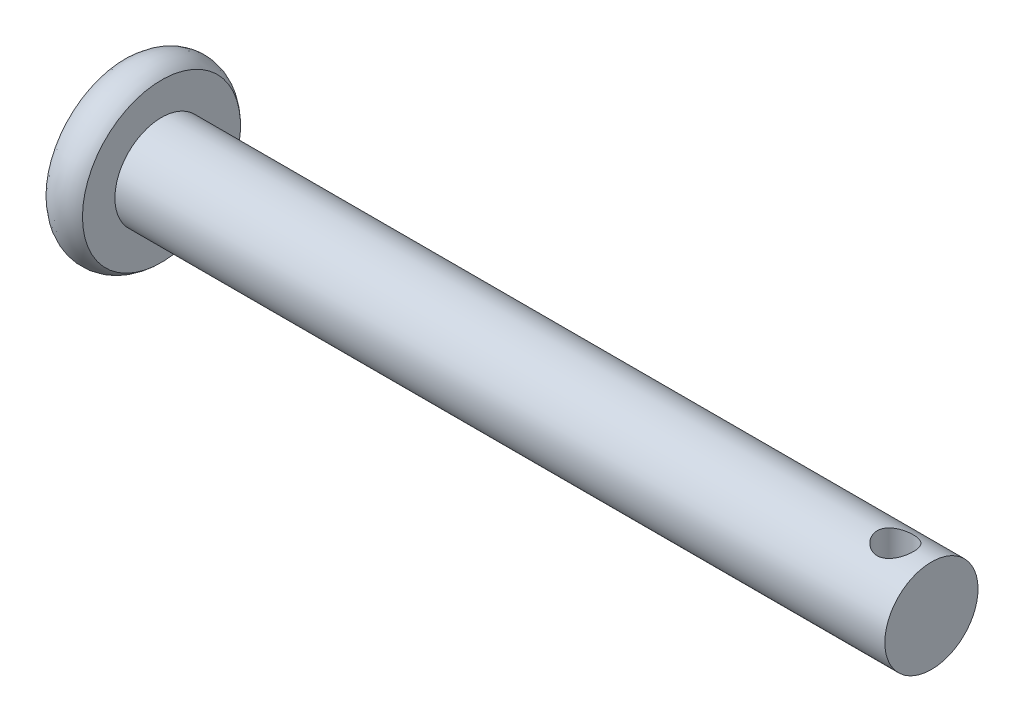
ISO-10303-21;
HEADER;
FILE_DESCRIPTION(('STEP AP214'),'2;1');
FILE_NAME('part.step','',(''),(''),'','','');
FILE_SCHEMA(('AUTOMOTIVE_DESIGN { 1 0 10303 214 1 1 1 1 }'));
ENDSEC;
DATA;
#1=APPLICATION_CONTEXT('core data for automotive mechanical design processes');
#2=APPLICATION_PROTOCOL_DEFINITION('international standard','automotive_design',2000,#1);
#3=PRODUCT_CONTEXT('',#1,'mechanical');
#4=PRODUCT('Part','Part','',(#3));
#5=PRODUCT_RELATED_PRODUCT_CATEGORY('part','',(#4));
#6=PRODUCT_DEFINITION_FORMATION('','',#4);
#7=PRODUCT_DEFINITION_CONTEXT('part definition',#1,'design');
#8=PRODUCT_DEFINITION('design','',#6,#7);
#9=PRODUCT_DEFINITION_SHAPE('','',#8);
#10=(LENGTH_UNIT() NAMED_UNIT(*) SI_UNIT(.MILLI.,.METRE.));
#11=(NAMED_UNIT(*) PLANE_ANGLE_UNIT() SI_UNIT($,.RADIAN.));
#12=(NAMED_UNIT(*) SI_UNIT($,.STERADIAN.) SOLID_ANGLE_UNIT());
#13=UNCERTAINTY_MEASURE_WITH_UNIT(LENGTH_MEASURE(1.E-05),#10,'distance_accuracy_value','');
#14=(GEOMETRIC_REPRESENTATION_CONTEXT(3) GLOBAL_UNCERTAINTY_ASSIGNED_CONTEXT((#13)) GLOBAL_UNIT_ASSIGNED_CONTEXT((#10,
#11,#12)) REPRESENTATION_CONTEXT('',''));
#15=CARTESIAN_POINT('',(0.,0.,0.));
#16=DIRECTION('',(0.,0.,1.));
#17=DIRECTION('',(1.,0.,0.));
#18=AXIS2_PLACEMENT_3D('',#15,#16,#17);
#19=CARTESIAN_POINT('',(-14.257685783,3.9,0.));
#20=DIRECTION('',(1.,0.,0.));
#21=DIRECTION('',(0.,0.,-1.));
#22=AXIS2_PLACEMENT_3D('',#19,#20,#21);
#23=PLANE('',#22);
#24=CARTESIAN_POINT('',(-14.257685783,0.,0.));
#25=DIRECTION('',(-1.,0.,0.));
#26=DIRECTION('',(0.,0.,1.));
#27=AXIS2_PLACEMENT_3D('',#24,#25,#26);
#28=CIRCLE('',#27,3.899999999713);
#29=CARTESIAN_POINT('',(-14.257685783,0.,3.899999999713));
#30=VERTEX_POINT('',#29);
#31=EDGE_CURVE('E18',#30,#30,#28,.F.);
#32=ORIENTED_EDGE('',*,*,#31,.F.);
#33=EDGE_LOOP('',(#32));
#34=FACE_BOUND('',#33,.T.);
#35=ADVANCED_FACE('F15',(#34),#23,.F.);
#36=CARTESIAN_POINT('',(-14.2576857828368,0.,3.89999999987616));
#37=CARTESIAN_POINT('',(-13.7304779890289,0.,4.42720779368412));
#38=CARTESIAN_POINT('',(-12.9848935768368,0.,4.42720779368411));
#39=CARTESIAN_POINT('',(-12.4576857830289,0.,3.89999999987614));
#40=(BOUNDED_CURVE() B_SPLINE_CURVE(3,(#36,#37,#38,#39),.UNSPECIFIED.,.F.,
.F.) B_SPLINE_CURVE_WITH_KNOTS((4,4),(0.,1.),
.UNSPECIFIED.) CURVE() GEOMETRIC_REPRESENTATION_ITEM() RATIONAL_B_SPLINE_CURVE((1.,
0.804737854124365,0.804737854124365,1.)) REPRESENTATION_ITEM(''));
#41=CARTESIAN_POINT('',(-13.357685783,0.,0.));
#42=DIRECTION('',(-1.,0.,0.));
#43=AXIS1_PLACEMENT('',#41,#42);
#44=SURFACE_OF_REVOLUTION('',#40,#43);
#45=CARTESIAN_POINT('',(-12.457685783,0.,0.));
#46=DIRECTION('',(-1.,0.,0.));
#47=DIRECTION('',(0.,0.,1.));
#48=AXIS2_PLACEMENT_3D('',#45,#46,#47);
#49=CIRCLE('',#48,3.89999999984727);
#50=CARTESIAN_POINT('',(-12.457685783,0.,3.89999999984727));
#51=VERTEX_POINT('',#50);
#52=EDGE_CURVE('E111',#51,#51,#49,.F.);
#53=ORIENTED_EDGE('',*,*,#52,.F.);
#54=EDGE_LOOP('',(#53));
#55=FACE_BOUND('',#54,.T.);
#56=ORIENTED_EDGE('',*,*,#31,.T.);
#57=EDGE_LOOP('',(#56));
#58=FACE_BOUND('',#57,.T.);
#59=ADVANCED_FACE('F54',(#55,#58),#44,.F.);
#60=CARTESIAN_POINT('',(25.542314217,0.,0.));
#61=DIRECTION('',(-1.,0.,0.));
#62=DIRECTION('',(0.,0.,1.));
#63=AXIS2_PLACEMENT_3D('',#60,#61,#62);
#64=PLANE('',#63);
#65=CARTESIAN_POINT('',(25.542314217,0.,0.));
#66=DIRECTION('',(-1.,0.,0.));
#67=DIRECTION('',(0.,-1.,0.));
#68=AXIS2_PLACEMENT_3D('',#65,#66,#67);
#69=CIRCLE('',#68,2.3);
#70=CARTESIAN_POINT('',(25.542314217,-2.30000000000001,0.));
#71=VERTEX_POINT('',#70);
#72=EDGE_CURVE('E114',#71,#71,#69,.T.);
#73=ORIENTED_EDGE('',*,*,#72,.F.);
#74=EDGE_LOOP('',(#73));
#75=FACE_BOUND('',#74,.T.);
#76=ADVANCED_FACE('F51',(#75),#64,.F.);
#77=CARTESIAN_POINT('',(-12.457685783,2.3,0.));
#78=DIRECTION('',(-1.,0.,0.));
#79=DIRECTION('',(0.,0.,1.));
#80=AXIS2_PLACEMENT_3D('',#77,#78,#79);
#81=PLANE('',#80);
#82=CARTESIAN_POINT('',(-12.457685783,0.,0.));
#83=DIRECTION('',(-1.,0.,0.));
#84=DIRECTION('',(0.,-1.,0.));
#85=AXIS2_PLACEMENT_3D('',#82,#83,#84);
#86=CIRCLE('',#85,2.3);
#87=CARTESIAN_POINT('',(-12.457685783,-2.3,0.));
#88=VERTEX_POINT('',#87);
#89=EDGE_CURVE('E27',#88,#88,#86,.F.);
#90=ORIENTED_EDGE('',*,*,#89,.F.);
#91=EDGE_LOOP('',(#90));
#92=FACE_BOUND('',#91,.T.);
#93=ORIENTED_EDGE('',*,*,#52,.T.);
#94=EDGE_LOOP('',(#93));
#95=FACE_BOUND('',#94,.T.);
#96=ADVANCED_FACE('F46',(#92,#95),#81,.F.);
#97=CARTESIAN_POINT('',(-12.457685783,0.,0.));
#98=DIRECTION('',(-1.,0.,0.));
#99=DIRECTION('',(0.,-1.,0.));
#100=AXIS2_PLACEMENT_3D('',#97,#98,#99);
#101=CYLINDRICAL_SURFACE('',#100,2.3);
#102=ORIENTED_EDGE('',*,*,#89,.T.);
#103=EDGE_LOOP('',(#102));
#104=FACE_BOUND('',#103,.T.);
#105=CARTESIAN_POINT('',(23.762820109,2.11960548226938,-0.892901225949819));
#106=CARTESIAN_POINT('',(23.7148153781979,2.11960837593618,-0.892898292083054));
#107=CARTESIAN_POINT('',(23.6667664062882,2.12125766769497,-0.889010187214511));
#108=CARTESIAN_POINT('',(23.5720766638275,2.1276436226949,-0.873612237687491));
#109=CARTESIAN_POINT('',(23.5254381926313,2.13238506978472,-0.862090582784489));
#110=CARTESIAN_POINT('',(23.4350417104632,2.1443328046021,-0.831923655590605));
#111=CARTESIAN_POINT('',(23.3912749433457,2.15153114058072,-0.813301342162308));
#112=CARTESIAN_POINT('',(23.3074847954919,2.1675707255735,-0.769531267699749));
#113=CARTESIAN_POINT('',(23.2674615020448,2.1764120128831,-0.744383354555326));
#114=CARTESIAN_POINT('',(23.1901358605708,2.19527208085859,-0.686832934393373));
#115=CARTESIAN_POINT('',(23.1530607404539,2.20532722685145,-0.654136920562359));
#116=CARTESIAN_POINT('',(23.0847571851557,2.22518017728969,-0.583038952624936));
#117=CARTESIAN_POINT('',(23.0535303427025,2.23497791100828,-0.544635449225455));
#118=CARTESIAN_POINT('',(22.9966977498751,2.25364654363507,-0.461472230071028));
#119=CARTESIAN_POINT('',(22.9713413069026,2.26247003270787,-0.416530540823756));
#120=CARTESIAN_POINT('',(22.9286442063295,2.27775714481733,-0.322615710217668));
#121=CARTESIAN_POINT('',(22.9113005578524,2.2842216481855,-0.27364408113898));
#122=CARTESIAN_POINT('',(22.885925550209,2.2938046348843,-0.175444709389579));
#123=CARTESIAN_POINT('',(22.8775032728692,2.29706308956369,-0.126331910940691));
#124=CARTESIAN_POINT('',(22.8689542779818,2.30037103898935,-0.0272891679768998));
#125=CARTESIAN_POINT('',(22.8688246604055,2.30042165554965,0.0226404847656051));
#126=CARTESIAN_POINT('',(22.8766439666058,2.29739524719843,0.119085411360107));
#127=CARTESIAN_POINT('',(22.8841653808557,2.29448373319023,0.165641462154227));
#128=CARTESIAN_POINT('',(22.906349960255,2.28608041777045,0.25677072904193));
#129=CARTESIAN_POINT('',(22.9210136520279,2.28058842609281,0.301343798659269));
#130=CARTESIAN_POINT('',(22.9572492120109,2.26746189411858,0.388031831174553));
#131=CARTESIAN_POINT('',(22.9789206306783,2.25979668762066,0.430100346252291));
#132=CARTESIAN_POINT('',(23.0284649452693,2.2430920253586,0.510108800901238));
#133=CARTESIAN_POINT('',(23.0563396615283,2.23405216645472,0.548047523723268));
#134=CARTESIAN_POINT('',(23.1195209887997,2.21485908208926,0.621223181342974));
#135=CARTESIAN_POINT('',(23.1551817665482,2.20467157831507,0.656145761771504));
#136=CARTESIAN_POINT('',(23.231916333415,2.18476890587343,0.71964936967132));
#137=CARTESIAN_POINT('',(23.272993241784,2.17505401383939,0.748226717154435));
#138=CARTESIAN_POINT('',(23.3607337294702,2.15696834646087,0.798894107710594));
#139=CARTESIAN_POINT('',(23.4075145110434,2.14863893385829,0.820796816127147));
#140=CARTESIAN_POINT('',(23.5044654388856,2.13475790250726,0.85625760015814));
#141=CARTESIAN_POINT('',(23.5546280351164,2.12920031437944,0.869833622682813));
#142=CARTESIAN_POINT('',(23.631545675529,2.12350831623707,0.88359154756072));
#143=CARTESIAN_POINT('',(23.6576524787044,2.12205103749954,0.887077110977887));
#144=CARTESIAN_POINT('',(23.7101084441207,2.12009882788941,0.891732751185142));
#145=CARTESIAN_POINT('',(23.7364576053991,2.11960389319683,0.892902837166395));
#146=CARTESIAN_POINT('',(23.8108248397948,2.11960837598079,0.892898292150838));
#147=CARTESIAN_POINT('',(23.8588738117037,2.1212576677066,0.889010187233493));
#148=CARTESIAN_POINT('',(23.9535635541668,2.12764362268233,0.873612237670717));
#149=CARTESIAN_POINT('',(24.000202025366,2.13238506978117,0.862090582780501));
#150=CARTESIAN_POINT('',(24.0905985075377,2.14433280460541,0.831923655595166));
#151=CARTESIAN_POINT('',(24.1343652746558,2.15153114058183,0.813301342162965));
#152=CARTESIAN_POINT('',(24.2181554225094,2.16757072557294,0.769531267697598));
#153=CARTESIAN_POINT('',(24.2581787159559,2.17641201288302,0.744383354554492));
#154=CARTESIAN_POINT('',(24.3355043574289,2.19527208085875,0.686832934393993));
#155=CARTESIAN_POINT('',(24.3725794775455,2.20532722685135,0.65413692056301));
#156=CARTESIAN_POINT('',(24.4408830328438,2.22518017728946,0.583038952625483));
#157=CARTESIAN_POINT('',(24.4721098752972,2.23497791100819,0.544635449225772));
#158=CARTESIAN_POINT('',(24.528942468125,2.25364654363512,0.46147223007092));
#159=CARTESIAN_POINT('',(24.5542989110976,2.26247003270793,0.416530540823476));
#160=CARTESIAN_POINT('',(24.5969960116706,2.27775714481737,0.322615710217348));
#161=CARTESIAN_POINT('',(24.6143396601476,2.28422164818551,0.273644081138818));
#162=CARTESIAN_POINT('',(24.639714667791,2.2938046348843,0.175444709389611));
#163=CARTESIAN_POINT('',(24.6481369451308,2.29706308956369,0.126331910940753));
#164=CARTESIAN_POINT('',(24.6566859400182,2.30037103898935,0.0272891679769617));
#165=CARTESIAN_POINT('',(24.6568155575945,2.30042165554965,-0.0226404847655741));
#166=CARTESIAN_POINT('',(24.6489962513942,2.29739524719843,-0.119085411360054));
#167=CARTESIAN_POINT('',(24.6414748371443,2.29448373319024,-0.165641462154123));
#168=CARTESIAN_POINT('',(24.6192902577451,2.28608041777046,-0.256770729041828));
#169=CARTESIAN_POINT('',(24.6046265659721,2.28058842609282,-0.301343798659218));
#170=CARTESIAN_POINT('',(24.568391005989,2.26746189411855,-0.388031831174733));
#171=CARTESIAN_POINT('',(24.5467195873215,2.2597966876206,-0.430100346252642));
#172=CARTESIAN_POINT('',(24.4971752727305,2.24309202535852,-0.510108800901537));
#173=CARTESIAN_POINT('',(24.4693005564715,2.23405216645466,-0.548047523723378));
#174=CARTESIAN_POINT('',(24.4061192292006,2.21485908208939,-0.621223181342618));
#175=CARTESIAN_POINT('',(24.3704584514525,2.20467157831538,-0.656145761770917));
#176=CARTESIAN_POINT('',(24.2937238845858,2.18476890587353,-0.719649369670582));
#177=CARTESIAN_POINT('',(24.2526469762164,2.17505401383913,-0.748226717153645));
#178=CARTESIAN_POINT('',(24.164906488529,2.15696834646106,-0.798894107711597));
#179=CARTESIAN_POINT('',(24.1181257069549,2.14863893385935,-0.820796816129981));
#180=CARTESIAN_POINT('',(24.0211747791126,2.1347579025057,-0.856257600156586));
#181=CARTESIAN_POINT('',(23.9710121828825,2.1292003143743,-0.869833622675352));
#182=CARTESIAN_POINT('',(23.8940945424707,2.12350831623961,-0.883591547564662));
#183=CARTESIAN_POINT('',(23.867987739295,2.1220510375069,-0.887077110989131));
#184=CARTESIAN_POINT('',(23.8155317738766,2.12009882788193,-0.891732751174193));
#185=CARTESIAN_POINT('',(23.7891826125962,2.11960389316972,-0.892902837125881));
#186=CARTESIAN_POINT('',(23.762820109,2.11960548226938,-0.892901225949819));
#187=B_SPLINE_CURVE_WITH_KNOTS('',3,(#105,#106,#107,#108,#109,#110,#111,#112,#113,#114,#115,
#116,#117,#118,#119,#120,#121,#122,#123,#124,#125,#126,#127,#128,#129,#130,#131,#132,#133,#134,
#135,#136,#137,#138,#139,#140,#141,#142,#143,#144,#145,#146,#147,#148,#149,#150,#151,#152,#153,
#154,#155,#156,#157,#158,#159,#160,#161,#162,#163,#164,#165,#166,#167,#168,#169,#170,#171,#172,
#173,#174,#175,#176,#177,#178,#179,#180,#181,#182,#183,#184,#185,#186),.UNSPECIFIED.,.T.,.F.,(4,
2,2,2,2,2,2,2,2,2,2,2,2,2,2,2,2,2,2,2,2,2,2,2,2,2,2,2,2,2,2,2,2,2,2,2,2,2,2,2,4),(0.,
0.143910645308526,0.288044463487623,0.431716146178508,0.575391178122672,0.726058734110936,
0.876767263630015,1.03302496062168,1.18922428524249,1.3382535779824,1.48723075335646,
1.62831747827091,1.76941460754864,1.91261133938583,2.05585014733272,2.20798922480796,
2.36021630788621,2.51638881394691,2.67222351995955,2.7512544800436,2.83028512641785,
2.9741957717277,3.11832958991487,3.26200127260821,3.40567630454992,3.55634386053692,
3.70705239005726,3.86331008704942,4.01950941166974,4.16853870440955,4.31751587978371,
4.45860260469799,4.59969973397589,4.74289646581366,4.88613527375997,5.03827435123363,
5.19050143431346,5.34667394037695,5.5025086463868,5.58153960647213,5.66057025284999),.UNSPECIFIED.);
#188=CARTESIAN_POINT('',(23.762820109,2.11960548226938,-0.892901225949819));
#189=VERTEX_POINT('',#188);
#190=EDGE_CURVE('E10',#189,#189,#187,.T.);
#191=ORIENTED_EDGE('',*,*,#190,.F.);
#192=EDGE_LOOP('',(#191));
#193=FACE_BOUND('',#192,.T.);
#194=ORIENTED_EDGE('',*,*,#72,.T.);
#195=EDGE_LOOP('',(#194));
#196=FACE_BOUND('',#195,.T.);
#197=CARTESIAN_POINT('',(23.762820109,-2.11960548226154,0.892901225937967));
#198=CARTESIAN_POINT('',(23.7148153781976,-2.11960837592563,0.892898292067127));
#199=CARTESIAN_POINT('',(23.6667664062876,-2.1212576676922,0.889010187210169));
#200=CARTESIAN_POINT('',(23.5720766638271,-2.12764362269781,0.873612237691663));
#201=CARTESIAN_POINT('',(23.5254381926315,-2.1323850697855,0.86209058278565));
#202=CARTESIAN_POINT('',(23.4350417104641,-2.14433280460124,0.831923655589799));
#203=CARTESIAN_POINT('',(23.3912749433468,-2.15153114058035,0.813301342162506));
#204=CARTESIAN_POINT('',(23.3074847954932,-2.16757072557347,0.769531267700797));
#205=CARTESIAN_POINT('',(23.2674615020459,-2.17641201288293,0.744383354556169));
#206=CARTESIAN_POINT('',(23.1901358605717,-2.19527208085832,0.686832934394054));
#207=CARTESIAN_POINT('',(23.1530607404547,-2.20532722685124,0.654136920563094));
#208=CARTESIAN_POINT('',(23.0847571851565,-2.22518017728951,0.583038952625814));
#209=CARTESIAN_POINT('',(23.0535303427033,-2.23497791100807,0.544635449226444));
#210=CARTESIAN_POINT('',(22.9966977498758,-2.25364654363485,0.461472230072215));
#211=CARTESIAN_POINT('',(22.9713413069033,-2.26247003270766,0.416530540825024));
#212=CARTESIAN_POINT('',(22.92864420633,-2.27775714481717,0.322615710219013));
#213=CARTESIAN_POINT('',(22.9113005578528,-2.28422164818537,0.273644081140314));
#214=CARTESIAN_POINT('',(22.8859255502092,-2.29380463488423,0.175444709390888));
#215=CARTESIAN_POINT('',(22.8775032728694,-2.29706308956365,0.126331910941986));
#216=CARTESIAN_POINT('',(22.8689542779818,-2.30037103898937,0.0272891679781779));
#217=CARTESIAN_POINT('',(22.8688246604055,-2.30042165554969,-0.0226404847643295));
#218=CARTESIAN_POINT('',(22.8766439666056,-2.29739524719852,-0.119085411358849));
#219=CARTESIAN_POINT('',(22.8841653808555,-2.29448373319035,-0.165641462152983));
#220=CARTESIAN_POINT('',(22.9063499602546,-2.28608041777061,-0.25677072904073));
#221=CARTESIAN_POINT('',(22.9210136520275,-2.280588426093,-0.3013437986581));
#222=CARTESIAN_POINT('',(22.9572492120104,-2.2674618941188,-0.388031831173437));
#223=CARTESIAN_POINT('',(22.9789206306777,-2.25979668762089,-0.430100346251199));
#224=CARTESIAN_POINT('',(23.0284649452686,-2.24309202535887,-0.510108800900201));
#225=CARTESIAN_POINT('',(23.0563396615276,-2.23405216645499,-0.548047523722264));
#226=CARTESIAN_POINT('',(23.1195209887988,-2.21485908208955,-0.621223181342045));
#227=CARTESIAN_POINT('',(23.1551817665473,-2.20467157831536,-0.656145761770618));
#228=CARTESIAN_POINT('',(23.2319163334139,-2.18476890587371,-0.71964936967053));
#229=CARTESIAN_POINT('',(23.2729932417829,-2.17505401383967,-0.748226717153697));
#230=CARTESIAN_POINT('',(23.360733729469,-2.15696834646112,-0.798894107709982));
#231=CARTESIAN_POINT('',(23.4075145110422,-2.14863893385852,-0.820796816126606));
#232=CARTESIAN_POINT('',(23.5044654388843,-2.13475790250744,-0.856257600157748));
#233=CARTESIAN_POINT('',(23.5546280351151,-2.12920031437959,-0.869833622682497));
#234=CARTESIAN_POINT('',(23.6315456755276,-2.12350831623718,-0.883591547560516));
#235=CARTESIAN_POINT('',(23.657652478703,-2.12205103749964,-0.887077110977719));
#236=CARTESIAN_POINT('',(23.7101084441192,-2.12009882788947,-0.891732751185054));
#237=CARTESIAN_POINT('',(23.7364576053976,-2.11960389319688,-0.89290283716635));
#238=CARTESIAN_POINT('',(23.8108248397934,-2.11960837598079,-0.892898292150921));
#239=CARTESIAN_POINT('',(23.8588738117025,-2.12125766770657,-0.889010187233634));
#240=CARTESIAN_POINT('',(23.9535635541659,-2.12764362268228,-0.873612237670927));
#241=CARTESIAN_POINT('',(24.0002020253652,-2.13238506978111,-0.862090582780721));
#242=CARTESIAN_POINT('',(24.090598507537,-2.14433280460533,-0.831923655595439));
#243=CARTESIAN_POINT('',(24.134365274655,-2.15153114058172,-0.81330134216332));
#244=CARTESIAN_POINT('',(24.2181554225085,-2.16757072557278,-0.76953126769814));
#245=CARTESIAN_POINT('',(24.2581787159549,-2.17641201288283,-0.744383354555141));
#246=CARTESIAN_POINT('',(24.3355043574279,-2.19527208085852,-0.686832934394821));
#247=CARTESIAN_POINT('',(24.3725794775446,-2.20532722685111,-0.654136920563898));
#248=CARTESIAN_POINT('',(24.4408830328429,-2.22518017728922,-0.58303895262649));
#249=CARTESIAN_POINT('',(24.4721098752964,-2.23497791100796,-0.544635449226835));
#250=CARTESIAN_POINT('',(24.5289424681243,-2.25364654363491,-0.461472230072084));
#251=CARTESIAN_POINT('',(24.5542989110969,-2.26247003270773,-0.416530540824681));
#252=CARTESIAN_POINT('',(24.5969960116701,-2.27775714481721,-0.32261571021862));
#253=CARTESIAN_POINT('',(24.6143396601472,-2.28422164818538,-0.273644081140115));
#254=CARTESIAN_POINT('',(24.6397146677907,-2.29380463488423,-0.175444709390927));
#255=CARTESIAN_POINT('',(24.6481369451306,-2.29706308956364,-0.126331910942063));
#256=CARTESIAN_POINT('',(24.6566859400182,-2.30037103898937,-0.0272891679782543));
#257=CARTESIAN_POINT('',(24.6568155575945,-2.30042165554969,0.0226404847642916));
#258=CARTESIAN_POINT('',(24.6489962513944,-2.29739524719853,0.119085411358783));
#259=CARTESIAN_POINT('',(24.6414748371445,-2.29448373319036,0.165641462152853));
#260=CARTESIAN_POINT('',(24.6192902577454,-2.28608041777062,0.256770729040604));
#261=CARTESIAN_POINT('',(24.6046265659726,-2.280588426093,0.301343798658037));
#262=CARTESIAN_POINT('',(24.5683910059895,-2.26746189411877,0.388031831173661));
#263=CARTESIAN_POINT('',(24.546719587322,-2.25979668762083,0.430100346251635));
#264=CARTESIAN_POINT('',(24.4971752727312,-2.24309202535877,0.510108800900573));
#265=CARTESIAN_POINT('',(24.4693005564723,-2.23405216645492,0.548047523722401));
#266=CARTESIAN_POINT('',(24.4061192292016,-2.21485908208971,0.621223181341604));
#267=CARTESIAN_POINT('',(24.3704584514536,-2.20467157831574,0.656145761769891));
#268=CARTESIAN_POINT('',(24.2937238845871,-2.18476890587385,0.719649369669617));
#269=CARTESIAN_POINT('',(24.2526469762176,-2.17505401383935,0.748226717152721));
#270=CARTESIAN_POINT('',(24.16490648853,-2.15696834646136,0.798894107711222));
#271=CARTESIAN_POINT('',(24.1181257069558,-2.14863893385984,0.82079681613011));
#272=CARTESIAN_POINT('',(24.0211747791134,-2.13475790250552,0.856257600155826));
#273=CARTESIAN_POINT('',(23.9710121828835,-2.12920031437324,0.869833622673274));
#274=CARTESIAN_POINT('',(23.894094542472,-2.12350831624032,0.883591547565389));
#275=CARTESIAN_POINT('',(23.8679877392963,-2.12205103750873,0.88707711099162));
#276=CARTESIAN_POINT('',(23.8155317738774,-2.12009882788023,0.891732751171519));
#277=CARTESIAN_POINT('',(23.7891826125966,-2.11960389316337,0.892902837116268));
#278=CARTESIAN_POINT('',(23.762820109,-2.11960548226154,0.892901225937967));
#279=B_SPLINE_CURVE_WITH_KNOTS('',3,(#197,#198,#199,#200,#201,#202,#203,#204,#205,#206,#207,
#208,#209,#210,#211,#212,#213,#214,#215,#216,#217,#218,#219,#220,#221,#222,#223,#224,#225,#226,
#227,#228,#229,#230,#231,#232,#233,#234,#235,#236,#237,#238,#239,#240,#241,#242,#243,#244,#245,
#246,#247,#248,#249,#250,#251,#252,#253,#254,#255,#256,#257,#258,#259,#260,#261,#262,#263,#264,
#265,#266,#267,#268,#269,#270,#271,#272,#273,#274,#275,#276,#277,#278),.UNSPECIFIED.,.T.,.F.,(4,
2,2,2,2,2,2,2,2,2,2,2,2,2,2,2,2,2,2,2,2,2,2,2,2,2,2,2,2,2,2,2,2,2,2,2,2,2,2,2,4),(0.,
0.143910645308651,0.28804446348628,0.431716146176271,0.575391178120683,0.726058734109208,
0.876767263627955,1.0330249606195,1.18922428524045,1.33825357798043,1.48723075335451,
1.62831747826896,1.76941460754672,1.91261133938388,2.05585014733073,2.20798922480594,
2.36021630788415,2.51638881394485,2.67222351995751,2.75125448004147,2.83028512641562,
2.97419577172592,3.11832958991353,3.26200127260654,3.40567630454793,3.55634386053489,
3.7070523900552,3.86331008704736,4.01950941166769,4.16853870440757,4.31751587978176,
4.45860260469601,4.59969973397396,4.74289646581185,4.88613527375798,5.03827435123123,
5.1905014343114,5.34667394037556,5.50250864638476,5.5815396064703,5.66057025284893),.UNSPECIFIED.);
#280=CARTESIAN_POINT('',(23.762820109,-2.11960548226154,0.892901225937967));
#281=VERTEX_POINT('',#280);
#282=EDGE_CURVE('E22',#281,#281,#279,.T.);
#283=ORIENTED_EDGE('',*,*,#282,.F.);
#284=EDGE_LOOP('',(#283));
#285=FACE_BOUND('',#284,.T.);
#286=ADVANCED_FACE('F42',(#104,#193,#196,#285),#101,.T.);
#287=CARTESIAN_POINT('',(23.762820109,-2.32760458392624,0.));
#288=DIRECTION('',(0.,1.,0.));
#289=DIRECTION('',(0.,0.,1.));
#290=AXIS2_PLACEMENT_3D('',#287,#288,#289);
#291=CYLINDRICAL_SURFACE('',#290,0.892901226);
#292=ORIENTED_EDGE('',*,*,#190,.T.);
#293=EDGE_LOOP('',(#292));
#294=FACE_BOUND('',#293,.T.);
#295=ORIENTED_EDGE('',*,*,#282,.T.);
#296=EDGE_LOOP('',(#295));
#297=FACE_BOUND('',#296,.T.);
#298=ADVANCED_FACE('F40',(#294,#297),#291,.F.);
#299=CLOSED_SHELL('',(#35,#59,#76,#96,#286,#298));
#300=MANIFOLD_SOLID_BREP('B1',#299);
#301=ADVANCED_BREP_SHAPE_REPRESENTATION('',(#18,#300),#14);
#302=SHAPE_DEFINITION_REPRESENTATION(#9,#301);
ENDSEC;
END-ISO-10303-21;
